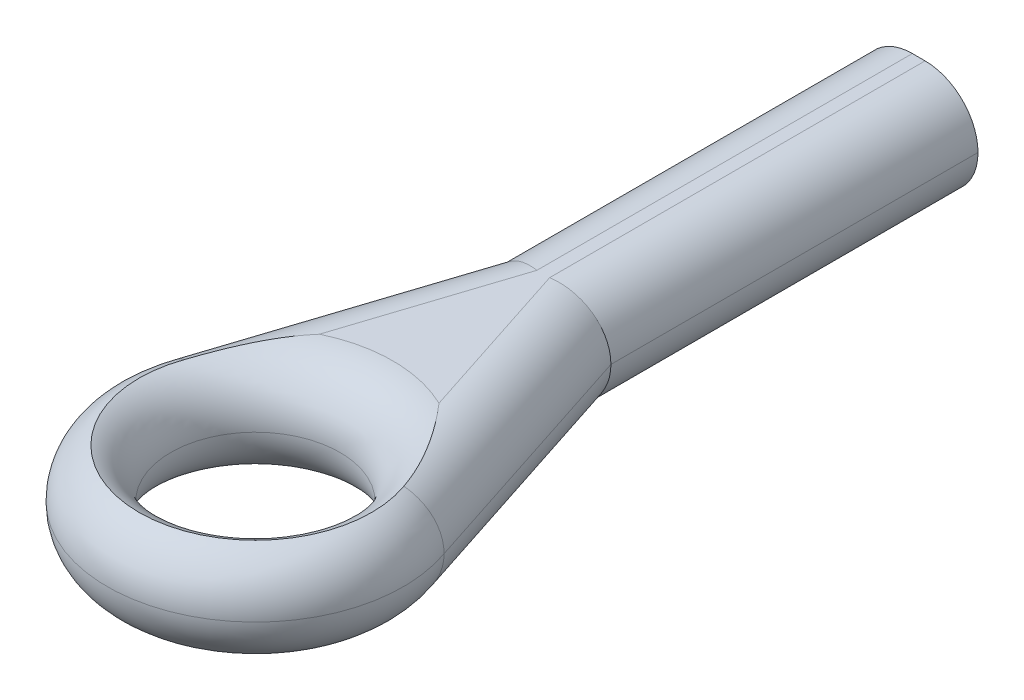
ISO-10303-21;
HEADER;
FILE_DESCRIPTION(('STEP AP214'),'2;1');
FILE_NAME('part.step','',(''),(''),'','','');
FILE_SCHEMA(('AUTOMOTIVE_DESIGN { 1 0 10303 214 1 1 1 1 }'));
ENDSEC;
DATA;
#1=APPLICATION_CONTEXT('core data for automotive mechanical design processes');
#2=APPLICATION_PROTOCOL_DEFINITION('international standard','automotive_design',2000,#1);
#3=PRODUCT_CONTEXT('',#1,'mechanical');
#4=PRODUCT('Part','Part','',(#3));
#5=PRODUCT_RELATED_PRODUCT_CATEGORY('part','',(#4));
#6=PRODUCT_DEFINITION_FORMATION('','',#4);
#7=PRODUCT_DEFINITION_CONTEXT('part definition',#1,'design');
#8=PRODUCT_DEFINITION('design','',#6,#7);
#9=PRODUCT_DEFINITION_SHAPE('','',#8);
#10=(LENGTH_UNIT() NAMED_UNIT(*) SI_UNIT(.MILLI.,.METRE.));
#11=(NAMED_UNIT(*) PLANE_ANGLE_UNIT() SI_UNIT($,.RADIAN.));
#12=(NAMED_UNIT(*) SI_UNIT($,.STERADIAN.) SOLID_ANGLE_UNIT());
#13=UNCERTAINTY_MEASURE_WITH_UNIT(LENGTH_MEASURE(1.E-05),#10,'distance_accuracy_value','');
#14=(GEOMETRIC_REPRESENTATION_CONTEXT(3) GLOBAL_UNCERTAINTY_ASSIGNED_CONTEXT((#13)) GLOBAL_UNIT_ASSIGNED_CONTEXT((#10,
#11,#12)) REPRESENTATION_CONTEXT('',''));
#15=CARTESIAN_POINT('',(0.,0.,0.));
#16=DIRECTION('',(0.,0.,1.));
#17=DIRECTION('',(1.,0.,0.));
#18=AXIS2_PLACEMENT_3D('',#15,#16,#17);
#19=CARTESIAN_POINT('',(0.908591555225163,2.5,24.5361814734429));
#20=DIRECTION('',(0.,1.,0.));
#21=DIRECTION('',(0.,0.,1.));
#22=AXIS2_PLACEMENT_3D('',#19,#20,#21);
#23=PLANE('',#22);
#24=DIRECTION('',(-0.309479113376526,0.,-0.950906240585096));
#25=VECTOR('',#24,1.);
#26=CARTESIAN_POINT('',(1.12048519347189,2.5,17.9197703889301));
#27=LINE('',#26,#25);
#28=CARTESIAN_POINT('',(2.32125475140915,2.5,21.609257713905));
#29=VERTEX_POINT('',#28);
#30=CARTESIAN_POINT('',(1.05911799420326,2.5,17.7312133903169));
#31=VERTEX_POINT('',#30);
#32=EDGE_CURVE('E134',#29,#31,#27,.T.);
#33=ORIENTED_EDGE('',*,*,#32,.T.);
#34=DIRECTION('',(0.,0.,-1.));
#35=VECTOR('',#34,1.);
#36=CARTESIAN_POINT('',(1.05911799420326,2.5,8.85618147344285));
#37=LINE('',#36,#35);
#38=CARTESIAN_POINT('',(1.05911799420326,2.5,8.85618147344285));
#39=VERTEX_POINT('',#38);
#40=EDGE_CURVE('E137',#31,#39,#37,.T.);
#41=ORIENTED_EDGE('',*,*,#40,.T.);
#42=DIRECTION('',(-1.,0.,0.));
#43=VECTOR('',#42,1.);
#44=CARTESIAN_POINT('',(2.30911799420326,2.5,8.85618147344285));
#45=LINE('',#44,#43);
#46=CARTESIAN_POINT('',(0.758065116247066,2.5,8.85618147344285));
#47=VERTEX_POINT('',#46);
#48=EDGE_CURVE('E317',#39,#47,#45,.T.);
#49=ORIENTED_EDGE('',*,*,#48,.T.);
#50=DIRECTION('',(0.,0.,1.));
#51=VECTOR('',#50,1.);
#52=CARTESIAN_POINT('',(0.758065116247067,2.5,17.5329214972095));
#53=LINE('',#52,#51);
#54=CARTESIAN_POINT('',(0.758065116247067,2.5,17.7312133903169));
#55=VERTEX_POINT('',#54);
#56=EDGE_CURVE('E304',#47,#55,#53,.T.);
#57=ORIENTED_EDGE('',*,*,#56,.T.);
#58=DIRECTION('',(-0.309479113376526,0.,0.950906240585096));
#59=VECTOR('',#58,1.);
#60=CARTESIAN_POINT('',(-1.20600038408468,2.5,23.7660055958609));
#61=LINE('',#60,#59);
#62=CARTESIAN_POINT('',(-0.504071640958827,2.5,21.609257713905));
#63=VERTEX_POINT('',#62);
#64=EDGE_CURVE('E302',#55,#63,#61,.T.);
#65=ORIENTED_EDGE('',*,*,#64,.T.);
#66=CARTESIAN_POINT('',(0.908591555225163,2.5,24.5361814734429));
#67=DIRECTION('',(0.,1.,0.));
#68=DIRECTION('',(0.,0.,1.));
#69=AXIS2_PLACEMENT_3D('',#66,#67,#68);
#70=CIRCLE('',#69,3.25);
#71=EDGE_CURVE('E139',#63,#29,#70,.F.);
#72=ORIENTED_EDGE('',*,*,#71,.T.);
#73=EDGE_LOOP('',(#33,#41,#49,#57,#65,#72));
#74=FACE_BOUND('',#73,.T.);
#75=ADVANCED_FACE('F40',(#74),#23,.T.);
#76=CARTESIAN_POINT('',(0.908591555225163,0.,24.5361814734429));
#77=DIRECTION('',(0.,1.,0.));
#78=DIRECTION('',(0.,0.,1.));
#79=AXIS2_PLACEMENT_3D('',#76,#77,#78);
#80=PLANE('',#79);
#81=DIRECTION('',(-1.,0.,0.));
#82=VECTOR('',#81,1.);
#83=CARTESIAN_POINT('',(2.30911799420326,0.,8.85618147344285));
#84=LINE('',#83,#82);
#85=CARTESIAN_POINT('',(1.05911799420326,0.,8.85618147344285));
#86=VERTEX_POINT('',#85);
#87=CARTESIAN_POINT('',(0.758065116247066,0.,8.85618147344285));
#88=VERTEX_POINT('',#87);
#89=EDGE_CURVE('E318',#86,#88,#84,.T.);
#90=ORIENTED_EDGE('',*,*,#89,.F.);
#91=DIRECTION('',(0.,0.,-1.));
#92=VECTOR('',#91,1.);
#93=CARTESIAN_POINT('',(1.05911799420326,0.,24.5361814734429));
#94=LINE('',#93,#92);
#95=CARTESIAN_POINT('',(1.05911799420326,0.,17.7312133903169));
#96=VERTEX_POINT('',#95);
#97=EDGE_CURVE('E306',#86,#96,#94,.F.);
#98=ORIENTED_EDGE('',*,*,#97,.T.);
#99=DIRECTION('',(-0.309479113376526,0.,-0.950906240585096));
#100=VECTOR('',#99,1.);
#101=CARTESIAN_POINT('',(3.0473052281049,0.,23.8401220902992));
#102=LINE('',#101,#100);
#103=CARTESIAN_POINT('',(2.32125475140915,0.,21.609257713905));
#104=VERTEX_POINT('',#103);
#105=EDGE_CURVE('E308',#96,#104,#102,.F.);
#106=ORIENTED_EDGE('',*,*,#105,.T.);
#107=CARTESIAN_POINT('',(0.908591555225163,0.,24.5361814734429));
#108=DIRECTION('',(0.,1.,0.));
#109=DIRECTION('',(0.,0.,1.));
#110=AXIS2_PLACEMENT_3D('',#107,#108,#109);
#111=CIRCLE('',#110,3.25);
#112=CARTESIAN_POINT('',(-0.504071640958827,0.,21.609257713905));
#113=VERTEX_POINT('',#112);
#114=EDGE_CURVE('E311',#104,#113,#111,.T.);
#115=ORIENTED_EDGE('',*,*,#114,.T.);
#116=DIRECTION('',(-0.309479113376526,0.,0.950906240585096));
#117=VECTOR('',#116,1.);
#118=CARTESIAN_POINT('',(-1.23012211765457,0.,23.8401220902992));
#119=LINE('',#118,#117);
#120=CARTESIAN_POINT('',(0.758065116247067,0.,17.7312133903169));
#121=VERTEX_POINT('',#120);
#122=EDGE_CURVE('E315',#113,#121,#119,.F.);
#123=ORIENTED_EDGE('',*,*,#122,.T.);
#124=DIRECTION('',(0.,0.,1.));
#125=VECTOR('',#124,1.);
#126=CARTESIAN_POINT('',(0.758065116247068,0.,24.5361814734429));
#127=LINE('',#126,#125);
#128=EDGE_CURVE('E313',#121,#88,#127,.F.);
#129=ORIENTED_EDGE('',*,*,#128,.T.);
#130=EDGE_LOOP('',(#90,#98,#106,#115,#123,#129));
#131=FACE_BOUND('',#130,.T.);
#132=ADVANCED_FACE('F246',(#131),#80,.F.);
#133=CARTESIAN_POINT('',(2.30911799420326,2.5,8.85618147344285));
#134=DIRECTION('',(0.,0.,1.));
#135=DIRECTION('',(1.,0.,0.));
#136=AXIS2_PLACEMENT_3D('',#133,#134,#135);
#137=PLANE('',#136);
#138=CARTESIAN_POINT('',(0.908591555225163,1.25,8.85618147344285));
#139=DIRECTION('',(0.,0.,-1.));
#140=DIRECTION('',(-1.,0.,0.));
#141=AXIS2_PLACEMENT_3D('',#138,#139,#140);
#142=CIRCLE('',#141,0.5);
#143=CARTESIAN_POINT('',(0.408591555225163,1.25,8.85618147344285));
#144=VERTEX_POINT('',#143);
#145=EDGE_CURVE('E11',#144,#144,#142,.T.);
#146=ORIENTED_EDGE('',*,*,#145,.F.);
#147=EDGE_LOOP('',(#146));
#148=FACE_BOUND('',#147,.T.);
#149=CARTESIAN_POINT('',(1.05911799420326,1.25,8.85618147344285));
#150=DIRECTION('',(0.,0.,1.));
#151=DIRECTION('',(1.,0.,0.));
#152=AXIS2_PLACEMENT_3D('',#149,#150,#151);
#153=CIRCLE('',#152,1.25);
#154=CARTESIAN_POINT('',(2.30911799420326,1.25,8.85618147344285));
#155=VERTEX_POINT('',#154);
#156=EDGE_CURVE('E59',#39,#155,#153,.F.);
#157=ORIENTED_EDGE('',*,*,#156,.T.);
#158=CARTESIAN_POINT('',(1.05911799420326,1.25,8.85618147344285));
#159=DIRECTION('',(0.,0.,1.));
#160=DIRECTION('',(1.,0.,0.));
#161=AXIS2_PLACEMENT_3D('',#158,#159,#160);
#162=CIRCLE('',#161,1.25);
#163=EDGE_CURVE('E50',#155,#86,#162,.F.);
#164=ORIENTED_EDGE('',*,*,#163,.T.);
#165=ORIENTED_EDGE('',*,*,#89,.T.);
#166=CARTESIAN_POINT('',(0.758065116247066,1.25,8.85618147344285));
#167=DIRECTION('',(0.,0.,1.));
#168=DIRECTION('',(1.,0.,0.));
#169=AXIS2_PLACEMENT_3D('',#166,#167,#168);
#170=CIRCLE('',#169,1.25);
#171=CARTESIAN_POINT('',(-0.491934883752934,1.25,8.85618147344285));
#172=VERTEX_POINT('',#171);
#173=EDGE_CURVE('E298',#88,#172,#170,.F.);
#174=ORIENTED_EDGE('',*,*,#173,.T.);
#175=CARTESIAN_POINT('',(0.758065116247066,1.25,8.85618147344285));
#176=DIRECTION('',(0.,0.,1.));
#177=DIRECTION('',(1.,0.,0.));
#178=AXIS2_PLACEMENT_3D('',#175,#176,#177);
#179=CIRCLE('',#178,1.25);
#180=EDGE_CURVE('E149',#172,#47,#179,.F.);
#181=ORIENTED_EDGE('',*,*,#180,.T.);
#182=ORIENTED_EDGE('',*,*,#48,.F.);
#183=EDGE_LOOP('',(#157,#164,#165,#174,#181,#182));
#184=FACE_BOUND('',#183,.T.);
#185=ADVANCED_FACE('F251',(#148,#184),#137,.F.);
#186=CARTESIAN_POINT('',(0.758065116247068,1.25,24.5361814734429));
#187=DIRECTION('',(0.,0.,-1.));
#188=DIRECTION('',(-1.,0.,0.));
#189=AXIS2_PLACEMENT_3D('',#186,#187,#188);
#190=CYLINDRICAL_SURFACE('',#189,1.25);
#191=ORIENTED_EDGE('',*,*,#56,.F.);
#192=ORIENTED_EDGE('',*,*,#180,.F.);
#193=DIRECTION('',(0.,0.,1.));
#194=VECTOR('',#193,1.);
#195=CARTESIAN_POINT('',(-0.491934883752934,1.25,8.85618147344285));
#196=LINE('',#195,#194);
#197=CARTESIAN_POINT('',(-0.491934883752933,1.25,17.5329214972095));
#198=VERTEX_POINT('',#197);
#199=EDGE_CURVE('E44',#198,#172,#196,.F.);
#200=ORIENTED_EDGE('',*,*,#199,.F.);
#201=CARTESIAN_POINT('',(0.758065116247067,1.25,17.7312133903169));
#202=DIRECTION('',(0.156674438589874,0.,-0.987650302633755));
#203=DIRECTION('',(0.987650302633755,0.,0.156674438589874));
#204=AXIS2_PLACEMENT_3D('',#201,#202,#203);
#205=ELLIPSE('',#204,1.26563014932172,1.25);
#206=EDGE_CURVE('E356',#55,#198,#205,.F.);
#207=ORIENTED_EDGE('',*,*,#206,.F.);
#208=EDGE_LOOP('',(#191,#192,#200,#207));
#209=FACE_BOUND('',#208,.T.);
#210=ADVANCED_FACE('F42',(#209),#190,.T.);
#211=CARTESIAN_POINT('',(0.758065116247066,1.25,8.85618147344285));
#212=DIRECTION('',(0.,0.,1.));
#213=DIRECTION('',(1.,0.,0.));
#214=AXIS2_PLACEMENT_3D('',#211,#212,#213);
#215=CYLINDRICAL_SURFACE('',#214,1.25);
#216=ORIENTED_EDGE('',*,*,#173,.F.);
#217=ORIENTED_EDGE('',*,*,#128,.F.);
#218=CARTESIAN_POINT('',(0.75806511624707,1.25,17.7312133903168));
#219=DIRECTION('',(-0.156674438589874,0.,0.987650302633755));
#220=DIRECTION('',(0.987650302633755,0.,0.156674438589874));
#221=AXIS2_PLACEMENT_3D('',#218,#219,#220);
#222=ELLIPSE('',#221,1.26563014932172,1.25);
#223=EDGE_CURVE('E354',#198,#121,#222,.T.);
#224=ORIENTED_EDGE('',*,*,#223,.F.);
#225=ORIENTED_EDGE('',*,*,#199,.T.);
#226=EDGE_LOOP('',(#216,#217,#224,#225));
#227=FACE_BOUND('',#226,.T.);
#228=ADVANCED_FACE('F212',(#227),#215,.T.);
#229=CARTESIAN_POINT('',(-1.23012211765457,1.25,23.8401220902992));
#230=DIRECTION('',(0.309479113376526,0.,-0.950906240585096));
#231=DIRECTION('',(-0.950906240585096,0.,-0.309479113376526));
#232=AXIS2_PLACEMENT_3D('',#229,#230,#231);
#233=CYLINDRICAL_SURFACE('',#232,1.25);
#234=ORIENTED_EDGE('',*,*,#64,.F.);
#235=ORIENTED_EDGE('',*,*,#206,.T.);
#236=DIRECTION('',(-0.309479113376526,0.,0.950906240585096));
#237=VECTOR('',#236,1.);
#238=CARTESIAN_POINT('',(-0.491934883752933,1.25,17.5329214972095));
#239=LINE('',#238,#237);
#240=CARTESIAN_POINT('',(-2.39463318481605,1.25,23.3791567041403));
#241=VERTEX_POINT('',#240);
#242=EDGE_CURVE('E204',#241,#198,#239,.F.);
#243=ORIENTED_EDGE('',*,*,#242,.F.);
#244=CARTESIAN_POINT('',(-2.39463318481605,1.25,23.3791567041403));
#245=CARTESIAN_POINT('',(-2.3946329685361,1.28516547978137,23.3791567951385));
#246=CARTESIAN_POINT('',(-2.3932263346227,1.32031411103879,23.3796319606794));
#247=CARTESIAN_POINT('',(-2.38761473859001,1.39035986813622,23.3815276932024));
#248=CARTESIAN_POINT('',(-2.38340991060275,1.42525700595058,23.3829482148686));
#249=CARTESIAN_POINT('',(-2.36663735338838,1.5291401714875,23.3886147946384));
#250=CARTESIAN_POINT('',(-2.3499114452347,1.59743028565012,23.3942659023034));
#251=CARTESIAN_POINT('',(-2.30583661715746,1.73007508538297,23.4091607464072));
#252=CARTESIAN_POINT('',(-2.27848260416843,1.79442786701557,23.4184062052867));
#253=CARTESIAN_POINT('',(-2.21393498116958,1.91736607229545,23.440230074379));
#254=CARTESIAN_POINT('',(-2.17674381662091,1.97595292436103,23.4528076562458));
#255=CARTESIAN_POINT('',(-2.09358009098584,2.08570012824756,23.4809447345496));
#256=CARTESIAN_POINT('',(-2.04760793144797,2.13686081947326,23.4965040946322));
#257=CARTESIAN_POINT('',(-1.94816568699883,2.23032940400874,23.5301786285903));
#258=CARTESIAN_POINT('',(-1.89469269572992,2.27263384986491,23.5482947931711));
#259=CARTESIAN_POINT('',(-1.78177083392001,2.34717772366058,23.5865765983118));
#260=CARTESIAN_POINT('',(-1.72231943221234,2.37941286449261,23.6067431069961));
#261=CARTESIAN_POINT('',(-1.59917962927554,2.43285305554635,23.6485456365339));
#262=CARTESIAN_POINT('',(-1.53549604842593,2.45407041994702,23.6701799861108));
#263=CARTESIAN_POINT('',(-1.43454043855771,2.47807625298562,23.7045069606371));
#264=CARTESIAN_POINT('',(-1.39807281310767,2.48486475005469,23.7169127051701));
#265=CARTESIAN_POINT('',(-1.32473202007689,2.49480148352445,23.7418755108062));
#266=CARTESIAN_POINT('',(-1.28785944099864,2.49795443838357,23.7544323543541));
#267=CARTESIAN_POINT('',(-1.23755917625535,2.49976035906563,23.771571832506));
#268=CARTESIAN_POINT('',(-1.22416928433455,2.50000066017242,23.7761353002223));
#269=CARTESIAN_POINT('',(-1.21078237049088,2.5,23.7806987383688));
#270=B_SPLINE_CURVE_WITH_KNOTS('',3,(#244,#245,#246,#247,#248,#249,#250,#251,#252,#253,#254,
#255,#256,#257,#258,#259,#260,#261,#262,#263,#264,#265,#266,#267,#268,#269),.UNSPECIFIED.,.F.,
.F.,(4,2,2,2,2,2,2,2,2,2,2,2,4),(0.,0.105431639108169,0.210858224692379,0.421378682224824,
0.632000147370761,0.842569302322383,1.05312883040357,1.26377017080227,1.47450107200779,
1.68499593704104,1.8021933324744,1.91923844919286,1.96167392620022),.UNSPECIFIED.);
#271=CARTESIAN_POINT('',(-1.68419396800435,2.3956439237394,23.6196863940598));
#272=VERTEX_POINT('',#271);
#273=EDGE_CURVE('E88',#272,#241,#270,.F.);
#274=ORIENTED_EDGE('',*,*,#273,.F.);
#275=CARTESIAN_POINT('',(-0.504071640958827,2.5,21.609257713905));
#276=CARTESIAN_POINT('',(-0.505896485736302,2.49999999459825,21.6113472163771));
#277=CARTESIAN_POINT('',(-0.507720110161053,2.49999857273661,21.6134378109507));
#278=CARTESIAN_POINT('',(-0.620409219692621,2.49982375313617,21.7427783286658));
#279=CARTESIAN_POINT('',(-0.726745350788456,2.4944507655738,21.8740651997316));
#280=CARTESIAN_POINT('',(-0.928701687661799,2.47831944697011,22.1443350179093));
#281=CARTESIAN_POINT('',(-1.02431543335215,2.46755789050089,22.2833225300164));
#282=CARTESIAN_POINT('',(-1.20364664729027,2.44529907897686,22.5689818078766));
#283=CARTESIAN_POINT('',(-1.28735235268945,2.43380111252361,22.7156609784856));
#284=CARTESIAN_POINT('',(-1.40292550902786,2.41909173427105,22.9408297010564));
#285=CARTESIAN_POINT('',(-1.43977226172595,2.41461288758193,23.0167112781389));
#286=CARTESIAN_POINT('',(-1.51003005445923,2.4068872514473,23.1701156212924));
#287=CARTESIAN_POINT('',(-1.54344119231021,2.40364042691768,23.2476383405623));
#288=CARTESIAN_POINT('',(-1.60981556081281,2.39844823049426,23.4118932207165));
#289=CARTESIAN_POINT('',(-1.6424099607934,2.39666270462985,23.4987798933919));
#290=CARTESIAN_POINT('',(-1.70314358454627,2.39510897375717,23.6740163219676));
#291=CARTESIAN_POINT('',(-1.73128722205255,2.39533875727214,23.7623645311965));
#292=CARTESIAN_POINT('',(-1.75716230909549,2.3966503271789,23.8513607379869));
#293=B_SPLINE_CURVE_WITH_KNOTS('',3,(#275,#276,#277,#278,#279,#280,#281,#282,#283,#284,#285,
#286,#287,#288,#289,#290,#291,#292),.UNSPECIFIED.,.F.,.F.,(4,2,2,2,2,2,2,2,4),(0.,
0.00832260109612326,0.514632556644413,1.02124593634251,1.52835632831264,1.7816985375163,
2.03503353178726,2.31334178543171,2.59137229173168),.UNSPECIFIED.);
#294=EDGE_CURVE('E216',#63,#272,#293,.T.);
#295=ORIENTED_EDGE('',*,*,#294,.F.);
#296=EDGE_LOOP('',(#234,#235,#243,#274,#295));
#297=FACE_BOUND('',#296,.T.);
#298=ADVANCED_FACE('F208',(#297),#233,.T.);
#299=CARTESIAN_POINT('',(0.696697916978436,1.25,17.9197703889301));
#300=DIRECTION('',(-0.309479113376526,0.,0.950906240585096));
#301=DIRECTION('',(0.950906240585096,0.,0.309479113376526));
#302=AXIS2_PLACEMENT_3D('',#299,#300,#301);
#303=CYLINDRICAL_SURFACE('',#302,1.25);
#304=ORIENTED_EDGE('',*,*,#223,.T.);
#305=ORIENTED_EDGE('',*,*,#122,.F.);
#306=CARTESIAN_POINT('',(-0.504071640958827,0.,21.609257713905));
#307=CARTESIAN_POINT('',(-0.505896485736302,5.40174690766544E-09,21.6113472163771));
#308=CARTESIAN_POINT('',(-0.507720110161053,1.42726339259586E-06,21.6134378109507));
#309=CARTESIAN_POINT('',(-0.620409219692562,0.000176246863832364,21.7427783286658));
#310=CARTESIAN_POINT('',(-0.726745350788344,0.00554923442619904,21.8740651997314));
#311=CARTESIAN_POINT('',(-0.928701687661593,0.0216805530298752,22.144335017909));
#312=CARTESIAN_POINT('',(-1.0243154333519,0.0324421094990816,22.283322530016));
#313=CARTESIAN_POINT('',(-1.20364664728996,0.0547009210230987,22.5689818078761));
#314=CARTESIAN_POINT('',(-1.28735235268911,0.0661988874763427,22.715660978485));
#315=CARTESIAN_POINT('',(-1.40292550902749,0.0809082657289018,22.9408297010556));
#316=CARTESIAN_POINT('',(-1.43977226172557,0.0853871124180261,23.0167112781381));
#317=CARTESIAN_POINT('',(-1.51003005445884,0.0931127485526567,23.1701156212915));
#318=CARTESIAN_POINT('',(-1.54344119230982,0.0963595730822884,23.2476383405614));
#319=CARTESIAN_POINT('',(-1.60981556081249,0.101551769505722,23.4118932207156));
#320=CARTESIAN_POINT('',(-1.64240996079316,0.103337295370141,23.4987798933912));
#321=CARTESIAN_POINT('',(-1.70314358454617,0.104891026242831,23.6740163219672));
#322=CARTESIAN_POINT('',(-1.7312872220525,0.104661242727865,23.7623645311964));
#323=CARTESIAN_POINT('',(-1.7571623090955,0.103349672821101,23.8513607379869));
#324=B_SPLINE_CURVE_WITH_KNOTS('',3,(#306,#307,#308,#309,#310,#311,#312,#313,#314,#315,#316,
#317,#318,#319,#320,#321,#322,#323),.UNSPECIFIED.,.F.,.F.,(4,2,2,2,2,2,2,2,4),(0.,
0.00832260109612326,0.514632556644145,1.02124593634198,1.52835632831186,1.78169853751538,
2.0350335317862,2.3133417854312,2.5913722917317),.UNSPECIFIED.);
#325=CARTESIAN_POINT('',(-1.68419396800401,0.10435607626104,23.6196863940599));
#326=VERTEX_POINT('',#325);
#327=EDGE_CURVE('E226',#326,#113,#324,.F.);
#328=ORIENTED_EDGE('',*,*,#327,.F.);
#329=CARTESIAN_POINT('',(-2.39463318481605,1.25,23.3791567041403));
#330=CARTESIAN_POINT('',(-2.3946329685361,1.21483452021863,23.3791567951385));
#331=CARTESIAN_POINT('',(-2.3932263346227,1.17968588896121,23.3796319606794));
#332=CARTESIAN_POINT('',(-2.38761473859001,1.10964013186378,23.3815276932024));
#333=CARTESIAN_POINT('',(-2.38340991060275,1.07474299404942,23.3829482148686));
#334=CARTESIAN_POINT('',(-2.36663735338839,0.970859828512502,23.3886147946384));
#335=CARTESIAN_POINT('',(-2.34991144523471,0.902569714349884,23.3942659023034));
#336=CARTESIAN_POINT('',(-2.30583661715746,0.769924914617032,23.4091607464072));
#337=CARTESIAN_POINT('',(-2.27848260416844,0.705572132984431,23.4184062052867));
#338=CARTESIAN_POINT('',(-2.21393498116958,0.582633927704555,23.440230074379));
#339=CARTESIAN_POINT('',(-2.17674381662091,0.524047075638972,23.4528076562458));
#340=CARTESIAN_POINT('',(-2.09358009098584,0.414299871752439,23.4809447345496));
#341=CARTESIAN_POINT('',(-2.04760793144797,0.363139180526745,23.4965040946322));
#342=CARTESIAN_POINT('',(-1.94816568699883,0.26967059599126,23.5301786285903));
#343=CARTESIAN_POINT('',(-1.89469269572991,0.22736615013509,23.548294793171));
#344=CARTESIAN_POINT('',(-1.78177083392,0.152822276339424,23.5865765983118));
#345=CARTESIAN_POINT('',(-1.72231943221234,0.120587135507387,23.6067431069961));
#346=CARTESIAN_POINT('',(-1.59917962927553,0.0671469444536556,23.6485456365339));
#347=CARTESIAN_POINT('',(-1.53549604842591,0.0459295800529761,23.6701799861107));
#348=CARTESIAN_POINT('',(-1.43454043855771,0.0219237470143809,23.7045069606371));
#349=CARTESIAN_POINT('',(-1.3980728131077,0.015135249945313,23.7169127051701));
#350=CARTESIAN_POINT('',(-1.32473202007692,0.00519851647554868,23.7418755108062));
#351=CARTESIAN_POINT('',(-1.28785944099864,0.00204556161643513,23.754432354354));
#352=CARTESIAN_POINT('',(-1.23755917625536,0.000239640934370624,23.7715718325059));
#353=CARTESIAN_POINT('',(-1.22416928433455,-6.60172421748594E-07,23.7761353002222));
#354=CARTESIAN_POINT('',(-1.2107823704909,0.,23.7806987383688));
#355=B_SPLINE_CURVE_WITH_KNOTS('',3,(#329,#330,#331,#332,#333,#334,#335,#336,#337,#338,#339,
#340,#341,#342,#343,#344,#345,#346,#347,#348,#349,#350,#351,#352,#353,#354),.UNSPECIFIED.,.F.,
.F.,(4,2,2,2,2,2,2,2,2,2,2,2,4),(0.,0.105431639108169,0.210858224692379,0.421378682224823,
0.632000147370759,0.842569302322383,1.05312883040357,1.26377017080227,1.47450107200779,
1.68499593704104,1.80219333247439,1.91923844919284,1.9616739262002),.UNSPECIFIED.);
#356=EDGE_CURVE('E276',#241,#326,#355,.T.);
#357=ORIENTED_EDGE('',*,*,#356,.F.);
#358=ORIENTED_EDGE('',*,*,#242,.T.);
#359=EDGE_LOOP('',(#304,#305,#328,#357,#358));
#360=FACE_BOUND('',#359,.T.);
#361=ADVANCED_FACE('F191',(#360),#303,.T.);
#362=CARTESIAN_POINT('',(0.908591555225163,1.25,24.5361814734429));
#363=DIRECTION('',(0.,1.,0.));
#364=DIRECTION('',(0.,0.,1.));
#365=AXIS2_PLACEMENT_3D('',#362,#363,#364);
#366=TOROIDAL_SURFACE('',#365,2.25,1.25);
#367=CARTESIAN_POINT('',(0.908591555225163,2.39564392373896,24.5361814734429));
#368=DIRECTION('',(0.,1.,0.));
#369=DIRECTION('',(0.,0.,1.));
#370=AXIS2_PLACEMENT_3D('',#367,#368,#369);
#371=CIRCLE('',#370,2.75);
#372=CARTESIAN_POINT('',(3.50137707845434,2.39564392373896,23.6196863940599));
#373=VERTEX_POINT('',#372);
#374=EDGE_CURVE('E205',#272,#373,#371,.T.);
#375=ORIENTED_EDGE('',*,*,#374,.F.);
#376=ORIENTED_EDGE('',*,*,#273,.T.);
#377=CARTESIAN_POINT('',(0.908591555225163,1.25,24.5361814734429));
#378=DIRECTION('',(0.,1.,0.));
#379=DIRECTION('',(0.,0.,1.));
#380=AXIS2_PLACEMENT_3D('',#377,#378,#379);
#381=CIRCLE('',#380,3.5);
#382=CARTESIAN_POINT('',(4.21181629526638,1.25,23.3791567041403));
#383=VERTEX_POINT('',#382);
#384=EDGE_CURVE('E282',#383,#241,#381,.F.);
#385=ORIENTED_EDGE('',*,*,#384,.F.);
#386=CARTESIAN_POINT('',(4.21181629526638,1.25,23.3791567041403));
#387=CARTESIAN_POINT('',(4.21181607898643,1.28516547978137,23.3791567951385));
#388=CARTESIAN_POINT('',(4.21040944507303,1.32031411103879,23.3796319606794));
#389=CARTESIAN_POINT('',(4.20479784904034,1.39035986813622,23.3815276932024));
#390=CARTESIAN_POINT('',(4.20059302105307,1.42525700595058,23.3829482148686));
#391=CARTESIAN_POINT('',(4.18382046383871,1.5291401714875,23.3886147946384));
#392=CARTESIAN_POINT('',(4.16709455568503,1.59743028565012,23.3942659023034));
#393=CARTESIAN_POINT('',(4.1230197276078,1.73007508538297,23.4091607464072));
#394=CARTESIAN_POINT('',(4.09566571461877,1.79442786701557,23.4184062052867));
#395=CARTESIAN_POINT('',(4.03111809161991,1.91736607229545,23.440230074379));
#396=CARTESIAN_POINT('',(3.99392692707123,1.97595292436103,23.4528076562458));
#397=CARTESIAN_POINT('',(3.91076320143616,2.08570012824756,23.4809447345496));
#398=CARTESIAN_POINT('',(3.8647910418983,2.13686081947326,23.4965040946322));
#399=CARTESIAN_POINT('',(3.76534879744916,2.23032940400874,23.5301786285903));
#400=CARTESIAN_POINT('',(3.71187580618024,2.27263384986491,23.5482947931711));
#401=CARTESIAN_POINT('',(3.59895394437033,2.34717772366058,23.5865765983118));
#402=CARTESIAN_POINT('',(3.53950254266267,2.37941286449261,23.6067431069961));
#403=CARTESIAN_POINT('',(3.41636273972586,2.43285305554635,23.6485456365339));
#404=CARTESIAN_POINT('',(3.35267915887624,2.45407041994702,23.6701799861108));
#405=CARTESIAN_POINT('',(3.25172354900804,2.47807625298562,23.7045069606371));
#406=CARTESIAN_POINT('',(3.21525592355802,2.48486475005469,23.7169127051701));
#407=CARTESIAN_POINT('',(3.14191513052719,2.49480148352445,23.7418755108061));
#408=CARTESIAN_POINT('',(3.10504255144888,2.49795443838357,23.7544323543538));
#409=CARTESIAN_POINT('',(3.05474228670562,2.49976035906563,23.7715718325058));
#410=CARTESIAN_POINT('',(3.04135239478483,2.50000066017242,23.7761353002221));
#411=CARTESIAN_POINT('',(3.0279654809412,2.5,23.7806987383688));
#412=B_SPLINE_CURVE_WITH_KNOTS('',3,(#386,#387,#388,#389,#390,#391,#392,#393,#394,#395,#396,
#397,#398,#399,#400,#401,#402,#403,#404,#405,#406,#407,#408,#409,#410,#411),.UNSPECIFIED.,.F.,
.F.,(4,2,2,2,2,2,2,2,2,2,2,2,4),(0.,0.105431639108169,0.210858224692378,0.421378682224824,
0.63200014737076,0.842569302322384,1.05312883040357,1.26377017080227,1.47450107200779,
1.68499593704104,1.80219333247441,1.91923844919286,1.96167392620022),.UNSPECIFIED.);
#413=EDGE_CURVE('E160',#373,#383,#412,.F.);
#414=ORIENTED_EDGE('',*,*,#413,.F.);
#415=EDGE_LOOP('',(#375,#376,#385,#414));
#416=FACE_BOUND('',#415,.T.);
#417=ADVANCED_FACE('F187',(#416),#366,.T.);
#418=CARTESIAN_POINT('',(0.908591555225163,1.25,24.5361814734429));
#419=DIRECTION('',(0.,1.,0.));
#420=DIRECTION('',(0.,0.,1.));
#421=AXIS2_PLACEMENT_3D('',#418,#419,#420);
#422=TOROIDAL_SURFACE('',#421,3.25,1.25);
#423=ORIENTED_EDGE('',*,*,#294,.T.);
#424=ORIENTED_EDGE('',*,*,#374,.T.);
#425=CARTESIAN_POINT('',(3.57434541954582,2.3966503271789,23.8513607379869));
#426=CARTESIAN_POINT('',(3.55355135701394,2.39561236947792,23.7798545765196));
#427=CARTESIAN_POINT('',(3.53129696792668,2.39525432751859,23.708764921065));
#428=CARTESIAN_POINT('',(3.48392633603363,2.39584981847564,23.5675608724276));
#429=CARTESIAN_POINT('',(3.45881045306832,2.39680318664531,23.4974463578599));
#430=CARTESIAN_POINT('',(3.40580061456329,2.39997119787528,23.3583961164959));
#431=CARTESIAN_POINT('',(3.37790985878013,2.40218440179275,23.2894591369617));
#432=CARTESIAN_POINT('',(3.31940790729258,2.40770460838338,23.1527978515771));
#433=CARTESIAN_POINT('',(3.28879666362606,2.41101163034333,23.0850735671317));
#434=CARTESIAN_POINT('',(3.19325224355928,2.42221177908331,22.8843646346613));
#435=CARTESIAN_POINT('',(3.12439986482719,2.43139964668614,22.75329911738));
#436=CARTESIAN_POINT('',(2.97702994083836,2.45074162416013,22.4968339125309));
#437=CARTESIAN_POINT('',(2.89851295530179,2.46089567806745,22.3714338974232));
#438=CARTESIAN_POINT('',(2.77819709146318,2.47414607051019,22.1937522737878));
#439=CARTESIAN_POINT('',(2.73990862930811,2.47805635855059,22.1391289933811));
#440=CARTESIAN_POINT('',(2.66162346219177,2.48516859023293,22.0310900234045));
#441=CARTESIAN_POINT('',(2.62162702669788,2.48837064512398,21.9776741453611));
#442=CARTESIAN_POINT('',(2.49924793710705,2.49646659762519,21.8193181607788));
#443=CARTESIAN_POINT('',(2.41440088114827,2.49985964025263,21.7161599417564));
#444=CARTESIAN_POINT('',(2.32490321826987,2.49999857462768,21.6134378097937));
#445=CARTESIAN_POINT('',(2.32307959373824,2.49999999652746,21.6113472151112));
#446=CARTESIAN_POINT('',(2.32125475140915,2.5,21.609257713905));
#447=B_SPLINE_CURVE_WITH_KNOTS('',3,(#425,#426,#427,#428,#429,#430,#431,#432,#433,#434,#435,
#436,#437,#438,#439,#440,#441,#442,#443,#444,#445,#446),.UNSPECIFIED.,.F.,.F.,(4,2,2,2,2,2,2,2,
2,2,4),(0.,0.223405485236219,0.446782907583059,0.669905670747643,0.893032368341011,
1.33754071954664,1.78202333940688,1.98245304204056,2.18285123882338,2.58324916157592,
2.59157176267207),.UNSPECIFIED.);
#448=EDGE_CURVE('E157',#29,#373,#447,.F.);
#449=ORIENTED_EDGE('',*,*,#448,.F.);
#450=ORIENTED_EDGE('',*,*,#71,.F.);
#451=EDGE_LOOP('',(#423,#424,#449,#450));
#452=FACE_BOUND('',#451,.T.);
#453=CARTESIAN_POINT('',(0.908591555225163,1.25,24.5361814734429));
#454=DIRECTION('',(0.,1.,0.));
#455=DIRECTION('',(0.,0.,1.));
#456=AXIS2_PLACEMENT_3D('',#453,#454,#455);
#457=CIRCLE('',#456,2.);
#458=CARTESIAN_POINT('',(0.908591555225163,1.25,26.5361814734429));
#459=VERTEX_POINT('',#458);
#460=EDGE_CURVE('E223',#459,#459,#457,.T.);
#461=ORIENTED_EDGE('',*,*,#460,.F.);
#462=EDGE_LOOP('',(#461));
#463=FACE_BOUND('',#462,.T.);
#464=ADVANCED_FACE('F179',(#452,#463),#422,.T.);
#465=CARTESIAN_POINT('',(1.05911799420326,1.25,24.5361814734429));
#466=DIRECTION('',(0.,0.,1.));
#467=DIRECTION('',(1.,0.,0.));
#468=AXIS2_PLACEMENT_3D('',#465,#466,#467);
#469=CYLINDRICAL_SURFACE('',#468,1.25);
#470=ORIENTED_EDGE('',*,*,#156,.F.);
#471=ORIENTED_EDGE('',*,*,#40,.F.);
#472=CARTESIAN_POINT('',(1.05911799420326,1.25,17.7312133903169));
#473=DIRECTION('',(0.156674438589874,0.,0.987650302633755));
#474=DIRECTION('',(0.987650302633755,0.,-0.156674438589874));
#475=AXIS2_PLACEMENT_3D('',#472,#473,#474);
#476=ELLIPSE('',#475,1.26563014932172,1.25);
#477=CARTESIAN_POINT('',(2.30911799420326,1.25,17.5329214972095));
#478=VERTEX_POINT('',#477);
#479=EDGE_CURVE('E147',#478,#31,#476,.T.);
#480=ORIENTED_EDGE('',*,*,#479,.F.);
#481=DIRECTION('',(0.,0.,-1.));
#482=VECTOR('',#481,1.);
#483=CARTESIAN_POINT('',(2.30911799420326,1.25,17.5329214972095));
#484=LINE('',#483,#482);
#485=EDGE_CURVE('E158',#155,#478,#484,.F.);
#486=ORIENTED_EDGE('',*,*,#485,.F.);
#487=EDGE_LOOP('',(#470,#471,#480,#486));
#488=FACE_BOUND('',#487,.T.);
#489=ADVANCED_FACE('F146',(#488),#469,.T.);
#490=CARTESIAN_POINT('',(0.908591555225163,1.25,24.5361814734429));
#491=DIRECTION('',(0.,1.,0.));
#492=DIRECTION('',(0.,0.,1.));
#493=AXIS2_PLACEMENT_3D('',#490,#491,#492);
#494=TOROIDAL_SURFACE('',#493,3.25,1.25);
#495=ORIENTED_EDGE('',*,*,#460,.T.);
#496=EDGE_LOOP('',(#495));
#497=FACE_BOUND('',#496,.T.);
#498=CARTESIAN_POINT('',(0.908591555225163,0.10435607626104,24.5361814734429));
#499=DIRECTION('',(0.,1.,0.));
#500=DIRECTION('',(0.,0.,1.));
#501=AXIS2_PLACEMENT_3D('',#498,#499,#500);
#502=CIRCLE('',#501,2.75);
#503=CARTESIAN_POINT('',(3.50137707845433,0.104356076261038,23.6196863940599));
#504=VERTEX_POINT('',#503);
#505=EDGE_CURVE('E233',#326,#504,#502,.T.);
#506=ORIENTED_EDGE('',*,*,#505,.F.);
#507=ORIENTED_EDGE('',*,*,#327,.T.);
#508=ORIENTED_EDGE('',*,*,#114,.F.);
#509=CARTESIAN_POINT('',(3.57434541954582,0.103349672821102,23.8513607379869));
#510=CARTESIAN_POINT('',(3.55355135701394,0.104387630522084,23.7798545765196));
#511=CARTESIAN_POINT('',(3.53129696792668,0.104745672481413,23.708764921065));
#512=CARTESIAN_POINT('',(3.48392633603364,0.104150181524364,23.5675608724276));
#513=CARTESIAN_POINT('',(3.45881045306833,0.103196813354695,23.4974463578599));
#514=CARTESIAN_POINT('',(3.40580061456329,0.100028802124725,23.3583961164959));
#515=CARTESIAN_POINT('',(3.37790985878014,0.0978155982072541,23.2894591369617));
#516=CARTESIAN_POINT('',(3.31940790729259,0.0922953916166172,23.1527978515771));
#517=CARTESIAN_POINT('',(3.28879666362606,0.0889883696566708,23.0850735671317));
#518=CARTESIAN_POINT('',(3.19325224355928,0.0777882209166862,22.8843646346613));
#519=CARTESIAN_POINT('',(3.1243998648272,0.0686003533138635,22.75329911738));
#520=CARTESIAN_POINT('',(2.97702994083836,0.0492583758398683,22.4968339125309));
#521=CARTESIAN_POINT('',(2.8985129553018,0.0391043219325466,22.3714338974232));
#522=CARTESIAN_POINT('',(2.77819709146318,0.0258539294898119,22.1937522737878));
#523=CARTESIAN_POINT('',(2.73990862930811,0.0219436414494055,22.1391289933811));
#524=CARTESIAN_POINT('',(2.66162346219177,0.0148314097670691,22.0310900234045));
#525=CARTESIAN_POINT('',(2.62162702669788,0.0116293548760219,21.9776741453611));
#526=CARTESIAN_POINT('',(2.49924793710705,0.00353340237480975,21.8193181607788));
#527=CARTESIAN_POINT('',(2.41440088114828,0.00014035974736607,21.7161599417564));
#528=CARTESIAN_POINT('',(2.32490321826987,1.42537231583018E-06,21.6134378097937));
#529=CARTESIAN_POINT('',(2.32307959373824,3.47254397894589E-09,21.6113472151112));
#530=CARTESIAN_POINT('',(2.32125475140915,0.,21.609257713905));
#531=B_SPLINE_CURVE_WITH_KNOTS('',3,(#509,#510,#511,#512,#513,#514,#515,#516,#517,#518,#519,
#520,#521,#522,#523,#524,#525,#526,#527,#528,#529,#530),.UNSPECIFIED.,.F.,.F.,(4,2,2,2,2,2,2,2,
2,2,4),(0.,0.223405485236215,0.446782907583051,0.669905670747635,0.893032368340999,
1.33754071954664,1.78202333940688,1.98245304204056,2.18285123882339,2.58324916157593,
2.59157176267207),.UNSPECIFIED.);
#532=EDGE_CURVE('E162',#504,#104,#531,.T.);
#533=ORIENTED_EDGE('',*,*,#532,.F.);
#534=EDGE_LOOP('',(#506,#507,#508,#533));
#535=FACE_BOUND('',#534,.T.);
#536=ADVANCED_FACE('F237',(#497,#535),#494,.T.);
#537=CARTESIAN_POINT('',(0.908591555225163,1.25,24.5361814734429));
#538=DIRECTION('',(0.,1.,0.));
#539=DIRECTION('',(0.,0.,1.));
#540=AXIS2_PLACEMENT_3D('',#537,#538,#539);
#541=TOROIDAL_SURFACE('',#540,2.25,1.25);
#542=ORIENTED_EDGE('',*,*,#356,.T.);
#543=ORIENTED_EDGE('',*,*,#505,.T.);
#544=CARTESIAN_POINT('',(4.21181629526638,1.25,23.3791567041403));
#545=CARTESIAN_POINT('',(4.21181607898643,1.21483452021863,23.3791567951385));
#546=CARTESIAN_POINT('',(4.21040944507303,1.17968588896121,23.3796319606794));
#547=CARTESIAN_POINT('',(4.20479784904034,1.10964013186378,23.3815276932024));
#548=CARTESIAN_POINT('',(4.20059302105307,1.07474299404942,23.3829482148686));
#549=CARTESIAN_POINT('',(4.18382046383871,0.970859828512502,23.3886147946384));
#550=CARTESIAN_POINT('',(4.16709455568503,0.902569714349884,23.3942659023034));
#551=CARTESIAN_POINT('',(4.1230197276078,0.769924914617032,23.4091607464072));
#552=CARTESIAN_POINT('',(4.09566571461877,0.705572132984431,23.4184062052867));
#553=CARTESIAN_POINT('',(4.03111809161992,0.582633927704555,23.440230074379));
#554=CARTESIAN_POINT('',(3.99392692707123,0.524047075638972,23.4528076562458));
#555=CARTESIAN_POINT('',(3.91076320143616,0.414299871752438,23.4809447345496));
#556=CARTESIAN_POINT('',(3.8647910418983,0.363139180526744,23.4965040946322));
#557=CARTESIAN_POINT('',(3.76534879744915,0.269670595991258,23.5301786285903));
#558=CARTESIAN_POINT('',(3.71187580618024,0.227366150135088,23.548294793171));
#559=CARTESIAN_POINT('',(3.59895394437033,0.152822276339422,23.5865765983118));
#560=CARTESIAN_POINT('',(3.53950254266266,0.120587135507386,23.6067431069961));
#561=CARTESIAN_POINT('',(3.41636273972585,0.0671469444536553,23.6485456365339));
#562=CARTESIAN_POINT('',(3.35267915887623,0.045929580052976,23.6701799861107));
#563=CARTESIAN_POINT('',(3.25172354900804,0.021923747014382,23.7045069606371));
#564=CARTESIAN_POINT('',(3.21525592355804,0.0151352499453147,23.7169127051701));
#565=CARTESIAN_POINT('',(3.14191513052726,0.00519851647555046,23.7418755108062));
#566=CARTESIAN_POINT('',(3.10504255144899,0.00204556161643639,23.754432354354));
#567=CARTESIAN_POINT('',(3.0547422867057,0.000239640934370983,23.7715718325059));
#568=CARTESIAN_POINT('',(3.0413523947849,-6.60172421617017E-07,23.7761353002222));
#569=CARTESIAN_POINT('',(3.02796548094124,0.,23.7806987383688));
#570=B_SPLINE_CURVE_WITH_KNOTS('',3,(#544,#545,#546,#547,#548,#549,#550,#551,#552,#553,#554,
#555,#556,#557,#558,#559,#560,#561,#562,#563,#564,#565,#566,#567,#568,#569),.UNSPECIFIED.,.F.,
.F.,(4,2,2,2,2,2,2,2,2,2,2,2,4),(0.,0.105431639108168,0.210858224692378,0.421378682224824,
0.63200014737076,0.842569302322382,1.05312883040357,1.26377017080227,1.47450107200779,
1.68499593704103,1.80219333247438,1.91923844919282,1.96167392620018),.UNSPECIFIED.);
#571=EDGE_CURVE('E270',#383,#504,#570,.T.);
#572=ORIENTED_EDGE('',*,*,#571,.F.);
#573=ORIENTED_EDGE('',*,*,#384,.T.);
#574=EDGE_LOOP('',(#542,#543,#572,#573));
#575=FACE_BOUND('',#574,.T.);
#576=ADVANCED_FACE('F186',(#575),#541,.T.);
#577=CARTESIAN_POINT('',(3.0473052281049,1.25,23.8401220902992));
#578=DIRECTION('',(0.309479113376526,0.,0.950906240585096));
#579=DIRECTION('',(0.950906240585096,0.,-0.309479113376526));
#580=AXIS2_PLACEMENT_3D('',#577,#578,#579);
#581=CYLINDRICAL_SURFACE('',#580,1.25);
#582=ORIENTED_EDGE('',*,*,#448,.T.);
#583=ORIENTED_EDGE('',*,*,#413,.T.);
#584=DIRECTION('',(-0.309479113376526,0.,-0.950906240585096));
#585=VECTOR('',#584,1.);
#586=CARTESIAN_POINT('',(4.21181629526638,1.25,23.3791567041403));
#587=LINE('',#586,#585);
#588=EDGE_CURVE('E155',#478,#383,#587,.F.);
#589=ORIENTED_EDGE('',*,*,#588,.F.);
#590=ORIENTED_EDGE('',*,*,#479,.T.);
#591=ORIENTED_EDGE('',*,*,#32,.F.);
#592=EDGE_LOOP('',(#582,#583,#589,#590,#591));
#593=FACE_BOUND('',#592,.T.);
#594=ADVANCED_FACE('F152',(#593),#581,.T.);
#595=CARTESIAN_POINT('',(1.05911799420326,1.25,8.85618147344285));
#596=DIRECTION('',(0.,0.,-1.));
#597=DIRECTION('',(-1.,0.,0.));
#598=AXIS2_PLACEMENT_3D('',#595,#596,#597);
#599=CYLINDRICAL_SURFACE('',#598,1.25);
#600=ORIENTED_EDGE('',*,*,#163,.F.);
#601=ORIENTED_EDGE('',*,*,#485,.T.);
#602=CARTESIAN_POINT('',(1.05911799420326,1.25,17.7312133903169));
#603=DIRECTION('',(-0.156674438589874,0.,-0.987650302633755));
#604=DIRECTION('',(-0.987650302633755,0.,0.156674438589874));
#605=AXIS2_PLACEMENT_3D('',#602,#603,#604);
#606=ELLIPSE('',#605,1.26563014932172,1.25);
#607=EDGE_CURVE('E292',#96,#478,#606,.F.);
#608=ORIENTED_EDGE('',*,*,#607,.F.);
#609=ORIENTED_EDGE('',*,*,#97,.F.);
#610=EDGE_LOOP('',(#600,#601,#608,#609));
#611=FACE_BOUND('',#610,.T.);
#612=ADVANCED_FACE('F185',(#611),#599,.T.);
#613=CARTESIAN_POINT('',(1.12048519347189,1.25,17.9197703889301));
#614=DIRECTION('',(-0.309479113376526,0.,-0.950906240585096));
#615=DIRECTION('',(-0.950906240585096,0.,0.309479113376526));
#616=AXIS2_PLACEMENT_3D('',#613,#614,#615);
#617=CYLINDRICAL_SURFACE('',#616,1.25);
#618=ORIENTED_EDGE('',*,*,#532,.T.);
#619=ORIENTED_EDGE('',*,*,#105,.F.);
#620=ORIENTED_EDGE('',*,*,#607,.T.);
#621=ORIENTED_EDGE('',*,*,#588,.T.);
#622=ORIENTED_EDGE('',*,*,#571,.T.);
#623=EDGE_LOOP('',(#618,#619,#620,#621,#622));
#624=FACE_BOUND('',#623,.T.);
#625=ADVANCED_FACE('F265',(#624),#617,.T.);
#626=CARTESIAN_POINT('',(0.908591555225163,1.25,8.35618147344285));
#627=DIRECTION('',(0.,0.,1.));
#628=DIRECTION('',(1.,0.,0.));
#629=AXIS2_PLACEMENT_3D('',#626,#627,#628);
#630=CYLINDRICAL_SURFACE('',#629,0.5);
#631=CARTESIAN_POINT('',(0.908591555225163,1.25,8.35618147344285));
#632=DIRECTION('',(0.,0.,-1.));
#633=DIRECTION('',(-1.,0.,0.));
#634=AXIS2_PLACEMENT_3D('',#631,#632,#633);
#635=CIRCLE('',#634,0.5);
#636=CARTESIAN_POINT('',(0.408591555225163,1.25,8.35618147344285));
#637=VERTEX_POINT('',#636);
#638=EDGE_CURVE('E293',#637,#637,#635,.T.);
#639=ORIENTED_EDGE('',*,*,#638,.F.);
#640=EDGE_LOOP('',(#639));
#641=FACE_BOUND('',#640,.T.);
#642=ORIENTED_EDGE('',*,*,#145,.T.);
#643=EDGE_LOOP('',(#642));
#644=FACE_BOUND('',#643,.T.);
#645=ADVANCED_FACE('F255',(#641,#644),#630,.T.);
#646=CARTESIAN_POINT('',(0.908591555225163,1.25,8.35618147344285));
#647=DIRECTION('',(0.,0.,-1.));
#648=DIRECTION('',(-1.,0.,0.));
#649=AXIS2_PLACEMENT_3D('',#646,#647,#648);
#650=PLANE('',#649);
#651=ORIENTED_EDGE('',*,*,#638,.T.);
#652=EDGE_LOOP('',(#651));
#653=FACE_BOUND('',#652,.T.);
#654=ADVANCED_FACE('F324',(#653),#650,.T.);
#655=CLOSED_SHELL('',(#75,#132,#185,#210,#228,#298,#361,#417,#464,#489,#536,#576,#594,#612,#625,
#645,#654));
#656=MANIFOLD_SOLID_BREP('B2',#655);
#657=ADVANCED_BREP_SHAPE_REPRESENTATION('',(#18,#656),#14);
#658=SHAPE_DEFINITION_REPRESENTATION(#9,#657);
ENDSEC;
END-ISO-10303-21;
